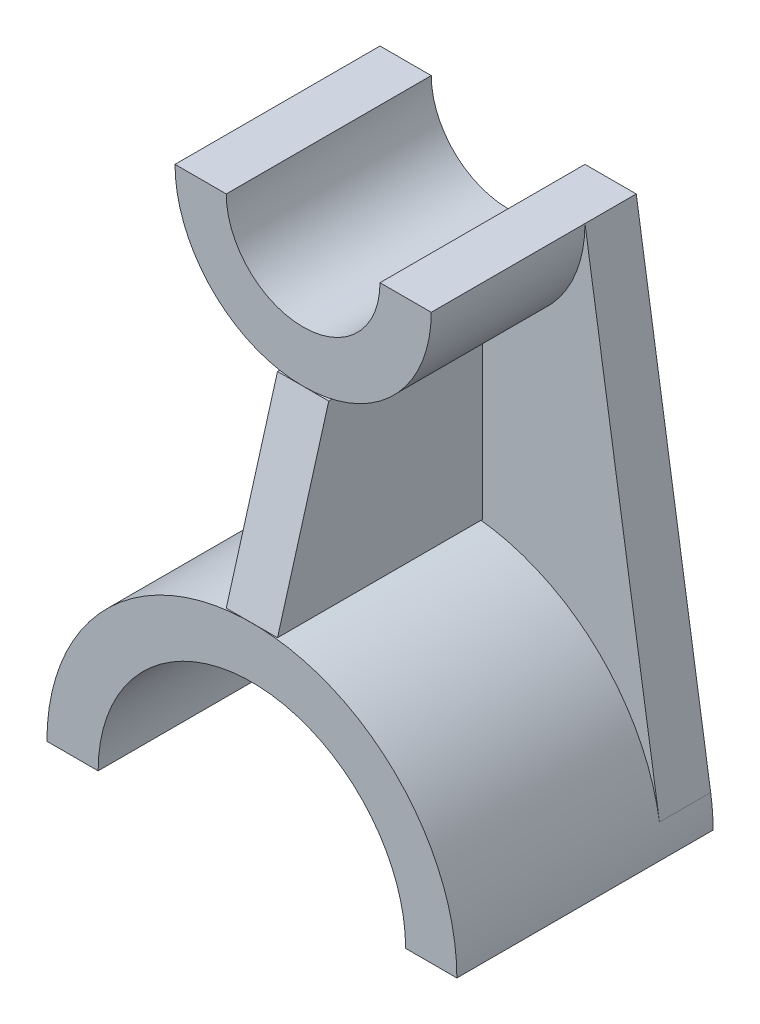
ISO-10303-21;
HEADER;
FILE_DESCRIPTION(('STEP AP214'),'2;1');
FILE_NAME('part.step','',(''),(''),'','','');
FILE_SCHEMA(('AUTOMOTIVE_DESIGN { 1 0 10303 214 1 1 1 1 }'));
ENDSEC;
DATA;
#1=APPLICATION_CONTEXT('core data for automotive mechanical design processes');
#2=APPLICATION_PROTOCOL_DEFINITION('international standard','automotive_design',2000,#1);
#3=PRODUCT_CONTEXT('',#1,'mechanical');
#4=PRODUCT('Part','Part','',(#3));
#5=PRODUCT_RELATED_PRODUCT_CATEGORY('part','',(#4));
#6=PRODUCT_DEFINITION_FORMATION('','',#4);
#7=PRODUCT_DEFINITION_CONTEXT('part definition',#1,'design');
#8=PRODUCT_DEFINITION('design','',#6,#7);
#9=PRODUCT_DEFINITION_SHAPE('','',#8);
#10=(LENGTH_UNIT() NAMED_UNIT(*) SI_UNIT(.MILLI.,.METRE.));
#11=(NAMED_UNIT(*) PLANE_ANGLE_UNIT() SI_UNIT($,.RADIAN.));
#12=(NAMED_UNIT(*) SI_UNIT($,.STERADIAN.) SOLID_ANGLE_UNIT());
#13=UNCERTAINTY_MEASURE_WITH_UNIT(LENGTH_MEASURE(1.E-05),#10,'distance_accuracy_value','');
#14=(GEOMETRIC_REPRESENTATION_CONTEXT(3) GLOBAL_UNCERTAINTY_ASSIGNED_CONTEXT((#13)) GLOBAL_UNIT_ASSIGNED_CONTEXT((#10,
#11,#12)) REPRESENTATION_CONTEXT('',''));
#15=CARTESIAN_POINT('',(0.,0.,0.));
#16=DIRECTION('',(0.,0.,1.));
#17=DIRECTION('',(1.,0.,0.));
#18=AXIS2_PLACEMENT_3D('',#15,#16,#17);
#19=CARTESIAN_POINT('',(5.,75.,40.));
#20=DIRECTION('',(0.,1.,0.));
#21=DIRECTION('',(0.,0.,1.));
#22=AXIS2_PLACEMENT_3D('',#19,#20,#21);
#23=PLANE('',#22);
#24=DIRECTION('',(0.,0.,-1.));
#25=VECTOR('',#24,1.);
#26=CARTESIAN_POINT('',(-5.,75.,40.));
#27=LINE('',#26,#25);
#28=CARTESIAN_POINT('',(-5.,75.,40.));
#29=VERTEX_POINT('',#28);
#30=CARTESIAN_POINT('',(-5.,75.,10.));
#31=VERTEX_POINT('',#30);
#32=EDGE_CURVE('E110',#29,#31,#27,.T.);
#33=ORIENTED_EDGE('',*,*,#32,.F.);
#34=DIRECTION('',(-1.,0.,0.));
#35=VECTOR('',#34,1.);
#36=CARTESIAN_POINT('',(5.,75.,40.));
#37=LINE('',#36,#35);
#38=CARTESIAN_POINT('',(5.,75.,40.));
#39=VERTEX_POINT('',#38);
#40=EDGE_CURVE('E12',#39,#29,#37,.T.);
#41=ORIENTED_EDGE('',*,*,#40,.F.);
#42=DIRECTION('',(0.,0.,-1.));
#43=VECTOR('',#42,1.);
#44=CARTESIAN_POINT('',(5.,75.,40.));
#45=LINE('',#44,#43);
#46=CARTESIAN_POINT('',(5.,75.,10.));
#47=VERTEX_POINT('',#46);
#48=EDGE_CURVE('E104',#39,#47,#45,.T.);
#49=ORIENTED_EDGE('',*,*,#48,.T.);
#50=DIRECTION('',(-1.,0.,0.));
#51=VECTOR('',#50,1.);
#52=CARTESIAN_POINT('',(5.,75.,10.));
#53=LINE('',#52,#51);
#54=EDGE_CURVE('E48',#47,#31,#53,.T.);
#55=ORIENTED_EDGE('',*,*,#54,.T.);
#56=EDGE_LOOP('',(#33,#41,#49,#55));
#57=FACE_BOUND('',#56,.T.);
#58=ADVANCED_FACE('F45',(#57),#23,.T.);
#59=CARTESIAN_POINT('',(5.,75.,40.));
#60=DIRECTION('',(0.,-0.274721127897378,-0.961523947640823));
#61=DIRECTION('',(0.,0.961523947640823,-0.274721127897378));
#62=AXIS2_PLACEMENT_3D('',#59,#60,#61);
#63=PLANE('',#62);
#64=DIRECTION('',(0.,-0.961523947640823,0.274721127897378));
#65=VECTOR('',#64,1.);
#66=CARTESIAN_POINT('',(-5.,75.,40.));
#67=LINE('',#66,#65);
#68=CARTESIAN_POINT('',(-5.,40.,50.));
#69=VERTEX_POINT('',#68);
#70=EDGE_CURVE('E106',#29,#69,#67,.T.);
#71=ORIENTED_EDGE('',*,*,#70,.T.);
#72=DIRECTION('',(-1.,0.,0.));
#73=VECTOR('',#72,1.);
#74=CARTESIAN_POINT('',(5.,40.,50.));
#75=LINE('',#74,#73);
#76=CARTESIAN_POINT('',(5.,40.,50.));
#77=VERTEX_POINT('',#76);
#78=EDGE_CURVE('E54',#77,#69,#75,.T.);
#79=ORIENTED_EDGE('',*,*,#78,.F.);
#80=DIRECTION('',(0.,-0.961523947640823,0.274721127897378));
#81=VECTOR('',#80,1.);
#82=CARTESIAN_POINT('',(5.,75.,40.));
#83=LINE('',#82,#81);
#84=EDGE_CURVE('E101',#39,#77,#83,.T.);
#85=ORIENTED_EDGE('',*,*,#84,.F.);
#86=ORIENTED_EDGE('',*,*,#40,.T.);
#87=EDGE_LOOP('',(#71,#79,#85,#86));
#88=FACE_BOUND('',#87,.T.);
#89=ADVANCED_FACE('F117',(#88),#63,.F.);
#90=CARTESIAN_POINT('',(5.,40.,10.));
#91=DIRECTION('',(0.,-1.,0.));
#92=DIRECTION('',(0.,0.,-1.));
#93=AXIS2_PLACEMENT_3D('',#90,#91,#92);
#94=PLANE('',#93);
#95=DIRECTION('',(0.,0.,1.));
#96=VECTOR('',#95,1.);
#97=CARTESIAN_POINT('',(-5.,40.,10.));
#98=LINE('',#97,#96);
#99=CARTESIAN_POINT('',(-5.,40.,10.));
#100=VERTEX_POINT('',#99);
#101=EDGE_CURVE('E95',#100,#69,#98,.T.);
#102=ORIENTED_EDGE('',*,*,#101,.F.);
#103=DIRECTION('',(-1.,0.,0.));
#104=VECTOR('',#103,1.);
#105=CARTESIAN_POINT('',(5.,40.,10.));
#106=LINE('',#105,#104);
#107=CARTESIAN_POINT('',(5.,40.,10.));
#108=VERTEX_POINT('',#107);
#109=EDGE_CURVE('E90',#108,#100,#106,.T.);
#110=ORIENTED_EDGE('',*,*,#109,.F.);
#111=DIRECTION('',(0.,0.,1.));
#112=VECTOR('',#111,1.);
#113=CARTESIAN_POINT('',(5.,40.,10.));
#114=LINE('',#113,#112);
#115=EDGE_CURVE('E93',#108,#77,#114,.T.);
#116=ORIENTED_EDGE('',*,*,#115,.T.);
#117=ORIENTED_EDGE('',*,*,#78,.T.);
#118=EDGE_LOOP('',(#102,#110,#116,#117));
#119=FACE_BOUND('',#118,.T.);
#120=ADVANCED_FACE('F92',(#119),#94,.T.);
#121=CARTESIAN_POINT('',(5.,75.,10.));
#122=DIRECTION('',(0.,0.,-1.));
#123=DIRECTION('',(-1.,0.,0.));
#124=AXIS2_PLACEMENT_3D('',#121,#122,#123);
#125=PLANE('',#124);
#126=DIRECTION('',(0.,-1.,0.));
#127=VECTOR('',#126,1.);
#128=CARTESIAN_POINT('',(-5.,75.,10.));
#129=LINE('',#128,#127);
#130=EDGE_CURVE('E113',#31,#100,#129,.T.);
#131=ORIENTED_EDGE('',*,*,#130,.F.);
#132=ORIENTED_EDGE('',*,*,#54,.F.);
#133=DIRECTION('',(0.,-1.,0.));
#134=VECTOR('',#133,1.);
#135=CARTESIAN_POINT('',(5.,75.,10.));
#136=LINE('',#135,#134);
#137=EDGE_CURVE('E100',#47,#108,#136,.T.);
#138=ORIENTED_EDGE('',*,*,#137,.T.);
#139=ORIENTED_EDGE('',*,*,#109,.T.);
#140=EDGE_LOOP('',(#131,#132,#138,#139));
#141=FACE_BOUND('',#140,.T.);
#142=ADVANCED_FACE('F103',(#141),#125,.T.);
#143=CARTESIAN_POINT('',(5.,0.,0.));
#144=DIRECTION('',(-1.,0.,0.));
#145=DIRECTION('',(0.,0.,1.));
#146=AXIS2_PLACEMENT_3D('',#143,#144,#145);
#147=PLANE('',#146);
#148=ORIENTED_EDGE('',*,*,#48,.F.);
#149=ORIENTED_EDGE('',*,*,#84,.T.);
#150=ORIENTED_EDGE('',*,*,#115,.F.);
#151=ORIENTED_EDGE('',*,*,#137,.F.);
#152=EDGE_LOOP('',(#148,#149,#150,#151));
#153=FACE_BOUND('',#152,.T.);
#154=ADVANCED_FACE('F99',(#153),#147,.F.);
#155=CARTESIAN_POINT('',(-5.,0.,0.));
#156=DIRECTION('',(-1.,0.,0.));
#157=DIRECTION('',(0.,0.,1.));
#158=AXIS2_PLACEMENT_3D('',#155,#156,#157);
#159=PLANE('',#158);
#160=ORIENTED_EDGE('',*,*,#32,.T.);
#161=ORIENTED_EDGE('',*,*,#130,.T.);
#162=ORIENTED_EDGE('',*,*,#101,.T.);
#163=ORIENTED_EDGE('',*,*,#70,.F.);
#164=EDGE_LOOP('',(#160,#161,#162,#163));
#165=FACE_BOUND('',#164,.T.);
#166=ADVANCED_FACE('F119',(#165),#159,.T.);
#167=CLOSED_SHELL('',(#58,#89,#120,#142,#154,#166));
#168=MANIFOLD_SOLID_BREP('B2',#167);
#169=CARTESIAN_POINT('',(0.,0.,50.));
#170=DIRECTION('',(0.,0.,-1.));
#171=DIRECTION('',(-1.,0.,0.));
#172=AXIS2_PLACEMENT_3D('',#169,#170,#171);
#173=CYLINDRICAL_SURFACE('',#172,40.);
#174=CARTESIAN_POINT('',(0.,0.,10.));
#175=DIRECTION('',(0.,0.,1.));
#176=DIRECTION('',(-1.,0.,0.));
#177=AXIS2_PLACEMENT_3D('',#174,#175,#176);
#178=CIRCLE('',#177,40.);
#179=CARTESIAN_POINT('',(39.5294117647059,6.11764705882355,10.));
#180=VERTEX_POINT('',#179);
#181=CARTESIAN_POINT('',(-39.5294117647059,6.11764705882355,10.));
#182=VERTEX_POINT('',#181);
#183=EDGE_CURVE('E187',#180,#182,#178,.T.);
#184=ORIENTED_EDGE('',*,*,#183,.T.);
#185=DIRECTION('',(0.,0.,-1.));
#186=VECTOR('',#185,1.);
#187=CARTESIAN_POINT('',(-39.5294117647059,6.11764705882355,10.));
#188=LINE('',#187,#186);
#189=CARTESIAN_POINT('',(-39.5294117647059,6.11764705882355,0.));
#190=VERTEX_POINT('',#189);
#191=EDGE_CURVE('E311',#182,#190,#188,.T.);
#192=ORIENTED_EDGE('',*,*,#191,.T.);
#193=CARTESIAN_POINT('',(0.,0.,0.));
#194=DIRECTION('',(0.,0.,1.));
#195=DIRECTION('',(-1.,0.,0.));
#196=AXIS2_PLACEMENT_3D('',#193,#194,#195);
#197=CIRCLE('',#196,40.);
#198=CARTESIAN_POINT('',(-40.,0.,0.));
#199=VERTEX_POINT('',#198);
#200=EDGE_CURVE('E310',#190,#199,#197,.T.);
#201=ORIENTED_EDGE('',*,*,#200,.T.);
#202=DIRECTION('',(0.,0.,-1.));
#203=VECTOR('',#202,1.);
#204=CARTESIAN_POINT('',(-40.,0.,50.));
#205=LINE('',#204,#203);
#206=CARTESIAN_POINT('',(-40.,0.,50.));
#207=VERTEX_POINT('',#206);
#208=EDGE_CURVE('E43',#207,#199,#205,.T.);
#209=ORIENTED_EDGE('',*,*,#208,.F.);
#210=CARTESIAN_POINT('',(0.,0.,50.));
#211=DIRECTION('',(0.,0.,1.));
#212=DIRECTION('',(-1.,0.,0.));
#213=AXIS2_PLACEMENT_3D('',#210,#211,#212);
#214=CIRCLE('',#213,40.);
#215=CARTESIAN_POINT('',(40.0000000000001,0.,50.));
#216=VERTEX_POINT('',#215);
#217=EDGE_CURVE('E316',#216,#207,#214,.T.);
#218=ORIENTED_EDGE('',*,*,#217,.F.);
#219=DIRECTION('',(0.,0.,-1.));
#220=VECTOR('',#219,1.);
#221=CARTESIAN_POINT('',(40.0000000000001,0.,50.));
#222=LINE('',#221,#220);
#223=CARTESIAN_POINT('',(40.0000000000001,0.,0.));
#224=VERTEX_POINT('',#223);
#225=EDGE_CURVE('E326',#216,#224,#222,.T.);
#226=ORIENTED_EDGE('',*,*,#225,.T.);
#227=CARTESIAN_POINT('',(39.5294117647059,6.11764705882355,0.));
#228=VERTEX_POINT('',#227);
#229=EDGE_CURVE('E327',#224,#228,#197,.T.);
#230=ORIENTED_EDGE('',*,*,#229,.T.);
#231=DIRECTION('',(0.,0.,-1.));
#232=VECTOR('',#231,1.);
#233=CARTESIAN_POINT('',(39.5294117647059,6.11764705882355,10.));
#234=LINE('',#233,#232);
#235=EDGE_CURVE('E183',#180,#228,#234,.T.);
#236=ORIENTED_EDGE('',*,*,#235,.F.);
#237=EDGE_LOOP('',(#184,#192,#201,#209,#218,#226,#230,#236));
#238=FACE_BOUND('',#237,.T.);
#239=ADVANCED_FACE('F169',(#238),#173,.T.);
#240=CARTESIAN_POINT('',(-40.,0.,50.));
#241=DIRECTION('',(0.,1.,0.));
#242=DIRECTION('',(0.,0.,1.));
#243=AXIS2_PLACEMENT_3D('',#240,#241,#242);
#244=PLANE('',#243);
#245=DIRECTION('',(1.,0.,0.));
#246=VECTOR('',#245,1.);
#247=CARTESIAN_POINT('',(-40.,0.,0.));
#248=LINE('',#247,#246);
#249=CARTESIAN_POINT('',(-30.,0.,0.));
#250=VERTEX_POINT('',#249);
#251=EDGE_CURVE('E329',#199,#250,#248,.T.);
#252=ORIENTED_EDGE('',*,*,#251,.T.);
#253=DIRECTION('',(0.,0.,-1.));
#254=VECTOR('',#253,1.);
#255=CARTESIAN_POINT('',(-30.,0.,50.));
#256=LINE('',#255,#254);
#257=CARTESIAN_POINT('',(-30.,0.,50.));
#258=VERTEX_POINT('',#257);
#259=EDGE_CURVE('E176',#258,#250,#256,.T.);
#260=ORIENTED_EDGE('',*,*,#259,.F.);
#261=DIRECTION('',(1.,0.,0.));
#262=VECTOR('',#261,1.);
#263=CARTESIAN_POINT('',(-40.,0.,50.));
#264=LINE('',#263,#262);
#265=EDGE_CURVE('E319',#207,#258,#264,.T.);
#266=ORIENTED_EDGE('',*,*,#265,.F.);
#267=ORIENTED_EDGE('',*,*,#208,.T.);
#268=EDGE_LOOP('',(#252,#260,#266,#267));
#269=FACE_BOUND('',#268,.T.);
#270=ADVANCED_FACE('F359',(#269),#244,.F.);
#271=CARTESIAN_POINT('',(0.,0.,50.));
#272=DIRECTION('',(0.,0.,-1.));
#273=DIRECTION('',(-1.,0.,0.));
#274=AXIS2_PLACEMENT_3D('',#271,#272,#273);
#275=CYLINDRICAL_SURFACE('',#274,30.);
#276=CARTESIAN_POINT('',(0.,0.,0.));
#277=DIRECTION('',(0.,0.,-1.));
#278=DIRECTION('',(-1.,0.,0.));
#279=AXIS2_PLACEMENT_3D('',#276,#277,#278);
#280=CIRCLE('',#279,30.);
#281=CARTESIAN_POINT('',(30.,0.,0.));
#282=VERTEX_POINT('',#281);
#283=EDGE_CURVE('E331',#250,#282,#280,.T.);
#284=ORIENTED_EDGE('',*,*,#283,.T.);
#285=DIRECTION('',(0.,0.,-1.));
#286=VECTOR('',#285,1.);
#287=CARTESIAN_POINT('',(30.,0.,50.));
#288=LINE('',#287,#286);
#289=CARTESIAN_POINT('',(30.,0.,50.));
#290=VERTEX_POINT('',#289);
#291=EDGE_CURVE('E336',#290,#282,#288,.T.);
#292=ORIENTED_EDGE('',*,*,#291,.F.);
#293=CARTESIAN_POINT('',(0.,0.,50.));
#294=DIRECTION('',(0.,0.,-1.));
#295=DIRECTION('',(-1.,0.,0.));
#296=AXIS2_PLACEMENT_3D('',#293,#294,#295);
#297=CIRCLE('',#296,30.);
#298=EDGE_CURVE('E322',#258,#290,#297,.T.);
#299=ORIENTED_EDGE('',*,*,#298,.F.);
#300=ORIENTED_EDGE('',*,*,#259,.T.);
#301=EDGE_LOOP('',(#284,#292,#299,#300));
#302=FACE_BOUND('',#301,.T.);
#303=ADVANCED_FACE('F343',(#302),#275,.F.);
#304=CARTESIAN_POINT('',(30.0000000000001,0.,50.));
#305=DIRECTION('',(0.,1.,0.));
#306=DIRECTION('',(0.,0.,1.));
#307=AXIS2_PLACEMENT_3D('',#304,#305,#306);
#308=PLANE('',#307);
#309=DIRECTION('',(1.,0.,0.));
#310=VECTOR('',#309,1.);
#311=CARTESIAN_POINT('',(30.0000000000001,0.,0.));
#312=LINE('',#311,#310);
#313=EDGE_CURVE('E320',#282,#224,#312,.T.);
#314=ORIENTED_EDGE('',*,*,#313,.T.);
#315=ORIENTED_EDGE('',*,*,#225,.F.);
#316=DIRECTION('',(1.,0.,0.));
#317=VECTOR('',#316,1.);
#318=CARTESIAN_POINT('',(30.0000000000001,0.,50.));
#319=LINE('',#318,#317);
#320=EDGE_CURVE('E324',#290,#216,#319,.T.);
#321=ORIENTED_EDGE('',*,*,#320,.F.);
#322=ORIENTED_EDGE('',*,*,#291,.T.);
#323=EDGE_LOOP('',(#314,#315,#321,#322));
#324=FACE_BOUND('',#323,.T.);
#325=ADVANCED_FACE('F353',(#324),#308,.F.);
#326=CARTESIAN_POINT('',(0.,0.,50.));
#327=DIRECTION('',(0.,0.,-1.));
#328=DIRECTION('',(-1.,0.,0.));
#329=AXIS2_PLACEMENT_3D('',#326,#327,#328);
#330=PLANE('',#329);
#331=ORIENTED_EDGE('',*,*,#217,.T.);
#332=ORIENTED_EDGE('',*,*,#265,.T.);
#333=ORIENTED_EDGE('',*,*,#298,.T.);
#334=ORIENTED_EDGE('',*,*,#320,.T.);
#335=EDGE_LOOP('',(#331,#332,#333,#334));
#336=FACE_BOUND('',#335,.T.);
#337=ADVANCED_FACE('F358',(#336),#330,.F.);
#338=CARTESIAN_POINT('',(0.,0.,0.));
#339=DIRECTION('',(0.,0.,-1.));
#340=DIRECTION('',(-1.,0.,0.));
#341=AXIS2_PLACEMENT_3D('',#338,#339,#340);
#342=PLANE('',#341);
#343=ORIENTED_EDGE('',*,*,#229,.F.);
#344=ORIENTED_EDGE('',*,*,#313,.F.);
#345=ORIENTED_EDGE('',*,*,#283,.F.);
#346=ORIENTED_EDGE('',*,*,#251,.F.);
#347=ORIENTED_EDGE('',*,*,#200,.F.);
#348=DIRECTION('',(0.152941176470589,0.988235294117647,0.));
#349=VECTOR('',#348,1.);
#350=CARTESIAN_POINT('',(-25.,100.,0.));
#351=LINE('',#350,#349);
#352=CARTESIAN_POINT('',(-25.,100.,0.));
#353=VERTEX_POINT('',#352);
#354=EDGE_CURVE('E296',#190,#353,#351,.T.);
#355=ORIENTED_EDGE('',*,*,#354,.T.);
#356=DIRECTION('',(1.,0.,0.));
#357=VECTOR('',#356,1.);
#358=CARTESIAN_POINT('',(0.,100.,0.));
#359=LINE('',#358,#357);
#360=CARTESIAN_POINT('',(-15.,100.,0.));
#361=VERTEX_POINT('',#360);
#362=EDGE_CURVE('E283',#353,#361,#359,.T.);
#363=ORIENTED_EDGE('',*,*,#362,.T.);
#364=CARTESIAN_POINT('',(0.,100.,0.));
#365=DIRECTION('',(0.,0.,1.));
#366=DIRECTION('',(1.,0.,0.));
#367=AXIS2_PLACEMENT_3D('',#364,#365,#366);
#368=CIRCLE('',#367,15.);
#369=CARTESIAN_POINT('',(15.,100.,0.));
#370=VERTEX_POINT('',#369);
#371=EDGE_CURVE('E256',#361,#370,#368,.T.);
#372=ORIENTED_EDGE('',*,*,#371,.T.);
#373=DIRECTION('',(1.,0.,0.));
#374=VECTOR('',#373,1.);
#375=CARTESIAN_POINT('',(0.,100.,0.));
#376=LINE('',#375,#374);
#377=CARTESIAN_POINT('',(25.,100.,0.));
#378=VERTEX_POINT('',#377);
#379=EDGE_CURVE('E270',#370,#378,#376,.T.);
#380=ORIENTED_EDGE('',*,*,#379,.T.);
#381=DIRECTION('',(0.152941176470589,-0.988235294117647,0.));
#382=VECTOR('',#381,1.);
#383=CARTESIAN_POINT('',(25.,100.,0.));
#384=LINE('',#383,#382);
#385=EDGE_CURVE('E261',#378,#228,#384,.T.);
#386=ORIENTED_EDGE('',*,*,#385,.T.);
#387=EDGE_LOOP('',(#343,#344,#345,#346,#347,#355,#363,#372,#380,#386));
#388=FACE_BOUND('',#387,.T.);
#389=ADVANCED_FACE('F350',(#388),#342,.T.);
#390=CARTESIAN_POINT('',(-25.,100.,10.));
#391=DIRECTION('',(-0.988235294117647,0.152941176470589,0.));
#392=DIRECTION('',(-0.152941176470589,-0.988235294117647,0.));
#393=AXIS2_PLACEMENT_3D('',#390,#391,#392);
#394=PLANE('',#393);
#395=ORIENTED_EDGE('',*,*,#354,.F.);
#396=ORIENTED_EDGE('',*,*,#191,.F.);
#397=DIRECTION('',(0.152941176470589,0.988235294117647,0.));
#398=VECTOR('',#397,1.);
#399=CARTESIAN_POINT('',(-25.,100.,10.));
#400=LINE('',#399,#398);
#401=CARTESIAN_POINT('',(-25.,100.,10.));
#402=VERTEX_POINT('',#401);
#403=EDGE_CURVE('E300',#182,#402,#400,.T.);
#404=ORIENTED_EDGE('',*,*,#403,.T.);
#405=DIRECTION('',(0.,0.,-1.));
#406=VECTOR('',#405,1.);
#407=CARTESIAN_POINT('',(-25.,100.,10.));
#408=LINE('',#407,#406);
#409=EDGE_CURVE('E308',#402,#353,#408,.T.);
#410=ORIENTED_EDGE('',*,*,#409,.T.);
#411=EDGE_LOOP('',(#395,#396,#404,#410));
#412=FACE_BOUND('',#411,.T.);
#413=ADVANCED_FACE('F371',(#412),#394,.T.);
#414=CARTESIAN_POINT('',(25.,100.,10.));
#415=DIRECTION('',(0.988235294117647,0.152941176470589,0.));
#416=DIRECTION('',(-0.152941176470589,0.988235294117647,0.));
#417=AXIS2_PLACEMENT_3D('',#414,#415,#416);
#418=PLANE('',#417);
#419=ORIENTED_EDGE('',*,*,#385,.F.);
#420=DIRECTION('',(0.,0.,-1.));
#421=VECTOR('',#420,1.);
#422=CARTESIAN_POINT('',(25.,100.,10.));
#423=LINE('',#422,#421);
#424=CARTESIAN_POINT('',(25.,100.,10.));
#425=VERTEX_POINT('',#424);
#426=EDGE_CURVE('E303',#425,#378,#423,.T.);
#427=ORIENTED_EDGE('',*,*,#426,.F.);
#428=DIRECTION('',(0.152941176470589,-0.988235294117647,0.));
#429=VECTOR('',#428,1.);
#430=CARTESIAN_POINT('',(25.,100.,10.));
#431=LINE('',#430,#429);
#432=EDGE_CURVE('E295',#425,#180,#431,.T.);
#433=ORIENTED_EDGE('',*,*,#432,.T.);
#434=ORIENTED_EDGE('',*,*,#235,.T.);
#435=EDGE_LOOP('',(#419,#427,#433,#434));
#436=FACE_BOUND('',#435,.T.);
#437=ADVANCED_FACE('F374',(#436),#418,.T.);
#438=CARTESIAN_POINT('',(0.,100.,10.));
#439=DIRECTION('',(0.,0.,-1.));
#440=DIRECTION('',(-1.,0.,0.));
#441=AXIS2_PLACEMENT_3D('',#438,#439,#440);
#442=PLANE('',#441);
#443=CARTESIAN_POINT('',(0.,100.,10.));
#444=DIRECTION('',(0.,0.,1.));
#445=DIRECTION('',(-1.,0.,0.));
#446=AXIS2_PLACEMENT_3D('',#443,#444,#445);
#447=CIRCLE('',#446,25.);
#448=EDGE_CURVE('E292',#402,#425,#447,.T.);
#449=ORIENTED_EDGE('',*,*,#448,.F.);
#450=ORIENTED_EDGE('',*,*,#403,.F.);
#451=ORIENTED_EDGE('',*,*,#183,.F.);
#452=ORIENTED_EDGE('',*,*,#432,.F.);
#453=EDGE_LOOP('',(#449,#450,#451,#452));
#454=FACE_BOUND('',#453,.T.);
#455=ADVANCED_FACE('F377',(#454),#442,.F.);
#456=CARTESIAN_POINT('',(0.,100.,40.));
#457=DIRECTION('',(0.,0.,-1.));
#458=DIRECTION('',(-1.,0.,0.));
#459=AXIS2_PLACEMENT_3D('',#456,#457,#458);
#460=CYLINDRICAL_SURFACE('',#459,25.);
#461=DIRECTION('',(0.,0.,-1.));
#462=VECTOR('',#461,1.);
#463=CARTESIAN_POINT('',(-25.,100.,40.));
#464=LINE('',#463,#462);
#465=CARTESIAN_POINT('',(-25.,100.,40.));
#466=VERTEX_POINT('',#465);
#467=EDGE_CURVE('E262',#466,#402,#464,.T.);
#468=ORIENTED_EDGE('',*,*,#467,.T.);
#469=ORIENTED_EDGE('',*,*,#448,.T.);
#470=DIRECTION('',(0.,0.,-1.));
#471=VECTOR('',#470,1.);
#472=CARTESIAN_POINT('',(25.,100.,40.));
#473=LINE('',#472,#471);
#474=CARTESIAN_POINT('',(25.,100.,40.));
#475=VERTEX_POINT('',#474);
#476=EDGE_CURVE('E288',#475,#425,#473,.T.);
#477=ORIENTED_EDGE('',*,*,#476,.F.);
#478=CARTESIAN_POINT('',(0.,100.,40.));
#479=DIRECTION('',(0.,0.,1.));
#480=DIRECTION('',(1.,0.,0.));
#481=AXIS2_PLACEMENT_3D('',#478,#479,#480);
#482=CIRCLE('',#481,25.);
#483=EDGE_CURVE('E276',#466,#475,#482,.T.);
#484=ORIENTED_EDGE('',*,*,#483,.F.);
#485=EDGE_LOOP('',(#468,#469,#477,#484));
#486=FACE_BOUND('',#485,.T.);
#487=ADVANCED_FACE('F384',(#486),#460,.T.);
#488=CARTESIAN_POINT('',(0.,100.,40.));
#489=DIRECTION('',(0.,0.,-1.));
#490=DIRECTION('',(-1.,0.,0.));
#491=AXIS2_PLACEMENT_3D('',#488,#489,#490);
#492=CYLINDRICAL_SURFACE('',#491,15.);
#493=ORIENTED_EDGE('',*,*,#371,.F.);
#494=DIRECTION('',(0.,0.,-1.));
#495=VECTOR('',#494,1.);
#496=CARTESIAN_POINT('',(-15.,100.,40.));
#497=LINE('',#496,#495);
#498=CARTESIAN_POINT('',(-15.,100.,40.));
#499=VERTEX_POINT('',#498);
#500=EDGE_CURVE('E250',#499,#361,#497,.T.);
#501=ORIENTED_EDGE('',*,*,#500,.F.);
#502=CARTESIAN_POINT('',(0.,100.,40.));
#503=DIRECTION('',(0.,0.,1.));
#504=DIRECTION('',(1.,0.,0.));
#505=AXIS2_PLACEMENT_3D('',#502,#503,#504);
#506=CIRCLE('',#505,15.);
#507=CARTESIAN_POINT('',(15.,100.,40.));
#508=VERTEX_POINT('',#507);
#509=EDGE_CURVE('E253',#499,#508,#506,.T.);
#510=ORIENTED_EDGE('',*,*,#509,.T.);
#511=DIRECTION('',(0.,0.,-1.));
#512=VECTOR('',#511,1.);
#513=CARTESIAN_POINT('',(15.,100.,40.));
#514=LINE('',#513,#512);
#515=EDGE_CURVE('E281',#508,#370,#514,.T.);
#516=ORIENTED_EDGE('',*,*,#515,.T.);
#517=EDGE_LOOP('',(#493,#501,#510,#516));
#518=FACE_BOUND('',#517,.T.);
#519=ADVANCED_FACE('F252',(#518),#492,.F.);
#520=CARTESIAN_POINT('',(0.,100.,40.));
#521=DIRECTION('',(0.,1.,0.));
#522=DIRECTION('',(0.,0.,1.));
#523=AXIS2_PLACEMENT_3D('',#520,#521,#522);
#524=PLANE('',#523);
#525=ORIENTED_EDGE('',*,*,#362,.F.);
#526=ORIENTED_EDGE('',*,*,#409,.F.);
#527=ORIENTED_EDGE('',*,*,#467,.F.);
#528=DIRECTION('',(1.,0.,0.));
#529=VECTOR('',#528,1.);
#530=CARTESIAN_POINT('',(0.,100.,40.));
#531=LINE('',#530,#529);
#532=EDGE_CURVE('E267',#466,#499,#531,.T.);
#533=ORIENTED_EDGE('',*,*,#532,.T.);
#534=ORIENTED_EDGE('',*,*,#500,.T.);
#535=EDGE_LOOP('',(#525,#526,#527,#533,#534));
#536=FACE_BOUND('',#535,.T.);
#537=ADVANCED_FACE('F272',(#536),#524,.T.);
#538=CARTESIAN_POINT('',(0.,100.,40.));
#539=DIRECTION('',(0.,1.,0.));
#540=DIRECTION('',(0.,0.,1.));
#541=AXIS2_PLACEMENT_3D('',#538,#539,#540);
#542=PLANE('',#541);
#543=ORIENTED_EDGE('',*,*,#379,.F.);
#544=ORIENTED_EDGE('',*,*,#515,.F.);
#545=DIRECTION('',(1.,0.,0.));
#546=VECTOR('',#545,1.);
#547=CARTESIAN_POINT('',(0.,100.,40.));
#548=LINE('',#547,#546);
#549=EDGE_CURVE('E269',#508,#475,#548,.T.);
#550=ORIENTED_EDGE('',*,*,#549,.T.);
#551=ORIENTED_EDGE('',*,*,#476,.T.);
#552=ORIENTED_EDGE('',*,*,#426,.T.);
#553=EDGE_LOOP('',(#543,#544,#550,#551,#552));
#554=FACE_BOUND('',#553,.T.);
#555=ADVANCED_FACE('F390',(#554),#542,.T.);
#556=CARTESIAN_POINT('',(0.,0.,40.));
#557=DIRECTION('',(0.,0.,1.));
#558=DIRECTION('',(1.,0.,0.));
#559=AXIS2_PLACEMENT_3D('',#556,#557,#558);
#560=PLANE('',#559);
#561=ORIENTED_EDGE('',*,*,#509,.F.);
#562=ORIENTED_EDGE('',*,*,#532,.F.);
#563=ORIENTED_EDGE('',*,*,#483,.T.);
#564=ORIENTED_EDGE('',*,*,#549,.F.);
#565=EDGE_LOOP('',(#561,#562,#563,#564));
#566=FACE_BOUND('',#565,.T.);
#567=ADVANCED_FACE('F266',(#566),#560,.T.);
#568=CLOSED_SHELL('',(#239,#270,#303,#325,#337,#389,#413,#437,#455,#487,#519,#537,#555,#567));
#569=MANIFOLD_SOLID_BREP('B6',#568);
#570=ADVANCED_BREP_SHAPE_REPRESENTATION('',(#18,#168,#569),#14);
#571=SHAPE_DEFINITION_REPRESENTATION(#9,#570);
ENDSEC;
END-ISO-10303-21;
